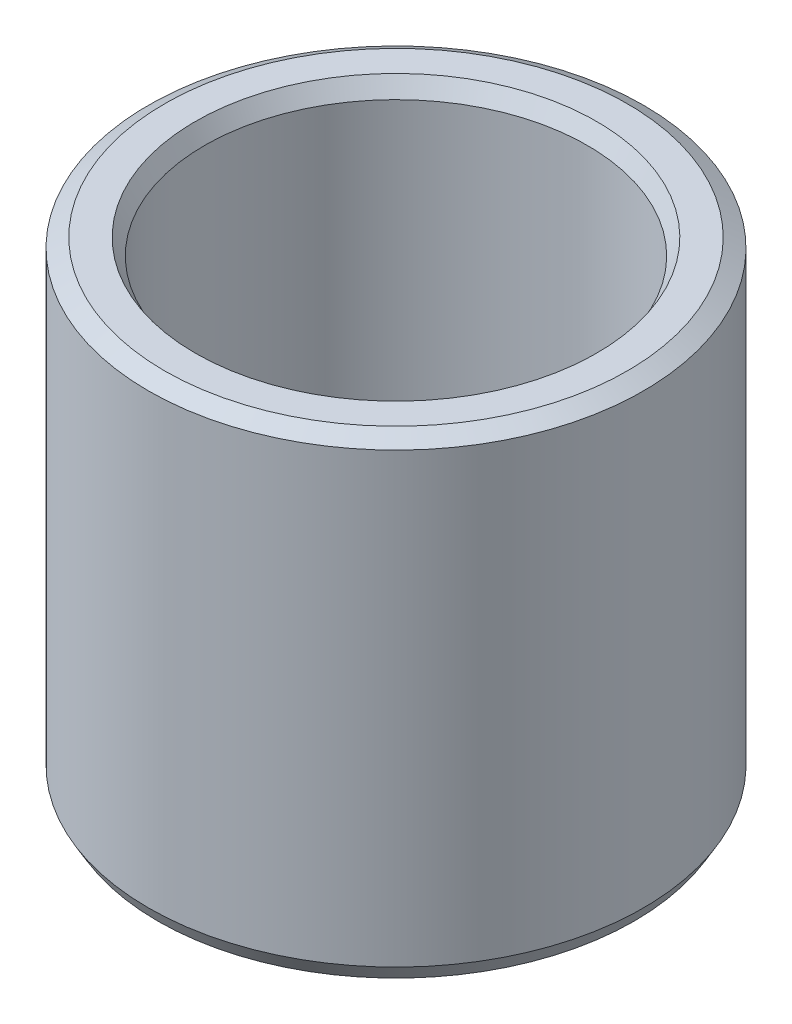
ISO-10303-21;
HEADER;
FILE_DESCRIPTION(('STEP AP214'),'2;1');
FILE_NAME('part.step','',(''),(''),'','','');
FILE_SCHEMA(('AUTOMOTIVE_DESIGN { 1 0 10303 214 1 1 1 1 }'));
ENDSEC;
DATA;
#1=APPLICATION_CONTEXT('core data for automotive mechanical design processes');
#2=APPLICATION_PROTOCOL_DEFINITION('international standard','automotive_design',2000,#1);
#3=PRODUCT_CONTEXT('',#1,'mechanical');
#4=PRODUCT('Part','Part','',(#3));
#5=PRODUCT_RELATED_PRODUCT_CATEGORY('part','',(#4));
#6=PRODUCT_DEFINITION_FORMATION('','',#4);
#7=PRODUCT_DEFINITION_CONTEXT('part definition',#1,'design');
#8=PRODUCT_DEFINITION('design','',#6,#7);
#9=PRODUCT_DEFINITION_SHAPE('','',#8);
#10=(LENGTH_UNIT() NAMED_UNIT(*) SI_UNIT(.MILLI.,.METRE.));
#11=(NAMED_UNIT(*) PLANE_ANGLE_UNIT() SI_UNIT($,.RADIAN.));
#12=(NAMED_UNIT(*) SI_UNIT($,.STERADIAN.) SOLID_ANGLE_UNIT());
#13=UNCERTAINTY_MEASURE_WITH_UNIT(LENGTH_MEASURE(1.E-05),#10,'distance_accuracy_value','');
#14=(GEOMETRIC_REPRESENTATION_CONTEXT(3) GLOBAL_UNCERTAINTY_ASSIGNED_CONTEXT((#13)) GLOBAL_UNIT_ASSIGNED_CONTEXT((#10,
#11,#12)) REPRESENTATION_CONTEXT('',''));
#15=CARTESIAN_POINT('',(0.,0.,0.));
#16=DIRECTION('',(0.,0.,1.));
#17=DIRECTION('',(1.,0.,0.));
#18=AXIS2_PLACEMENT_3D('',#15,#16,#17);
#19=CARTESIAN_POINT('',(0.,66.9073825895051,0.));
#20=DIRECTION('',(0.,-1.,0.));
#21=DIRECTION('',(0.,0.,-1.));
#22=AXIS2_PLACEMENT_3D('',#19,#20,#21);
#23=CYLINDRICAL_SURFACE('',#22,35.);
#24=CARTESIAN_POINT('',(0.,2.27796784596185,0.));
#25=DIRECTION('',(0.,1.,0.));
#26=DIRECTION('',(0.,0.,1.));
#27=AXIS2_PLACEMENT_3D('',#24,#25,#26);
#28=CIRCLE('',#27,35.);
#29=CARTESIAN_POINT('',(0.,2.27796784596185,35.));
#30=VERTEX_POINT('',#29);
#31=EDGE_CURVE('E10',#30,#30,#28,.T.);
#32=ORIENTED_EDGE('',*,*,#31,.T.);
#33=EDGE_LOOP('',(#32));
#34=FACE_BOUND('',#33,.T.);
#35=CARTESIAN_POINT('',(0.,65.5921972404337,0.));
#36=DIRECTION('',(0.,1.,0.));
#37=DIRECTION('',(0.,0.,1.));
#38=AXIS2_PLACEMENT_3D('',#35,#36,#37);
#39=CIRCLE('',#38,35.);
#40=CARTESIAN_POINT('',(0.,65.5921972404337,35.));
#41=VERTEX_POINT('',#40);
#42=EDGE_CURVE('E50',#41,#41,#39,.F.);
#43=ORIENTED_EDGE('',*,*,#42,.T.);
#44=EDGE_LOOP('',(#43));
#45=FACE_BOUND('',#44,.T.);
#46=ADVANCED_FACE('F39',(#34,#45),#23,.T.);
#47=CARTESIAN_POINT('',(0.,66.9073825895051,0.));
#48=DIRECTION('',(0.,1.,0.));
#49=DIRECTION('',(0.,0.,1.));
#50=AXIS2_PLACEMENT_3D('',#47,#48,#49);
#51=PLANE('',#50);
#52=CARTESIAN_POINT('',(0.,66.9073825895051,0.));
#53=DIRECTION('',(0.,1.,0.));
#54=DIRECTION('',(0.,0.,1.));
#55=AXIS2_PLACEMENT_3D('',#52,#53,#54);
#56=CIRCLE('',#55,28.384639879653);
#57=CARTESIAN_POINT('',(0.,66.9073825895051,28.384639879653));
#58=VERTEX_POINT('',#57);
#59=EDGE_CURVE('E58',#58,#58,#56,.F.);
#60=ORIENTED_EDGE('',*,*,#59,.T.);
#61=EDGE_LOOP('',(#60));
#62=FACE_BOUND('',#61,.T.);
#63=CARTESIAN_POINT('',(0.,66.9073825895051,0.));
#64=DIRECTION('',(0.,1.,0.));
#65=DIRECTION('',(0.,0.,1.));
#66=AXIS2_PLACEMENT_3D('',#63,#64,#65);
#67=CIRCLE('',#66,32.7220321540382);
#68=CARTESIAN_POINT('',(0.,66.9073825895051,32.7220321540382));
#69=VERTEX_POINT('',#68);
#70=EDGE_CURVE('E61',#69,#69,#67,.T.);
#71=ORIENTED_EDGE('',*,*,#70,.T.);
#72=EDGE_LOOP('',(#71));
#73=FACE_BOUND('',#72,.T.);
#74=ADVANCED_FACE('F88',(#62,#73),#51,.T.);
#75=CARTESIAN_POINT('',(0.,0.,0.));
#76=DIRECTION('',(0.,1.,0.));
#77=DIRECTION('',(0.,0.,1.));
#78=AXIS2_PLACEMENT_3D('',#75,#76,#77);
#79=PLANE('',#78);
#80=CARTESIAN_POINT('',(0.,0.,0.));
#81=DIRECTION('',(0.,1.,0.));
#82=DIRECTION('',(0.,0.,1.));
#83=AXIS2_PLACEMENT_3D('',#80,#81,#82);
#84=CIRCLE('',#83,29.3474223765435);
#85=CARTESIAN_POINT('',(0.,0.,29.3474223765435));
#86=VERTEX_POINT('',#85);
#87=EDGE_CURVE('E51',#86,#86,#84,.T.);
#88=ORIENTED_EDGE('',*,*,#87,.T.);
#89=EDGE_LOOP('',(#88));
#90=FACE_BOUND('',#89,.T.);
#91=CARTESIAN_POINT('',(0.,0.,0.));
#92=DIRECTION('',(0.,1.,0.));
#93=DIRECTION('',(0.,0.,1.));
#94=AXIS2_PLACEMENT_3D('',#91,#92,#93);
#95=CIRCLE('',#94,33.6848146509286);
#96=CARTESIAN_POINT('',(0.,0.,33.6848146509286));
#97=VERTEX_POINT('',#96);
#98=EDGE_CURVE('E54',#97,#97,#95,.F.);
#99=ORIENTED_EDGE('',*,*,#98,.T.);
#100=EDGE_LOOP('',(#99));
#101=FACE_BOUND('',#100,.T.);
#102=ADVANCED_FACE('F83',(#90,#101),#79,.F.);
#103=CARTESIAN_POINT('',(0.,66.9073825895051,0.));
#104=DIRECTION('',(0.,-1.,0.));
#105=DIRECTION('',(0.,0.,-1.));
#106=AXIS2_PLACEMENT_3D('',#103,#104,#105);
#107=CYLINDRICAL_SURFACE('',#106,27.0694545305817);
#108=CARTESIAN_POINT('',(0.,64.6294147435433,0.));
#109=DIRECTION('',(0.,1.,0.));
#110=DIRECTION('',(0.,0.,1.));
#111=AXIS2_PLACEMENT_3D('',#108,#109,#110);
#112=CIRCLE('',#111,27.0694545305817);
#113=CARTESIAN_POINT('',(0.,64.6294147435433,27.0694545305817));
#114=VERTEX_POINT('',#113);
#115=EDGE_CURVE('E67',#114,#114,#112,.T.);
#116=ORIENTED_EDGE('',*,*,#115,.T.);
#117=EDGE_LOOP('',(#116));
#118=FACE_BOUND('',#117,.T.);
#119=CARTESIAN_POINT('',(0.,1.31518534907137,0.));
#120=DIRECTION('',(0.,1.,0.));
#121=DIRECTION('',(0.,0.,1.));
#122=AXIS2_PLACEMENT_3D('',#119,#120,#121);
#123=CIRCLE('',#122,27.0694545305817);
#124=CARTESIAN_POINT('',(0.,1.31518534907137,27.0694545305817));
#125=VERTEX_POINT('',#124);
#126=EDGE_CURVE('E69',#125,#125,#123,.F.);
#127=ORIENTED_EDGE('',*,*,#126,.T.);
#128=EDGE_LOOP('',(#127));
#129=FACE_BOUND('',#128,.T.);
#130=ADVANCED_FACE('F71',(#118,#129),#107,.F.);
#131=CARTESIAN_POINT('',(0.,64.6294147435433,0.));
#132=DIRECTION('',(0.,1.,0.));
#133=DIRECTION('',(0.,0.,1.));
#134=AXIS2_PLACEMENT_3D('',#131,#132,#133);
#135=CONICAL_SURFACE('',#134,27.0694545305817,0.523598775598297);
#136=ORIENTED_EDGE('',*,*,#59,.F.);
#137=EDGE_LOOP('',(#136));
#138=FACE_BOUND('',#137,.T.);
#139=ORIENTED_EDGE('',*,*,#115,.F.);
#140=EDGE_LOOP('',(#139));
#141=FACE_BOUND('',#140,.T.);
#142=ADVANCED_FACE('F77',(#138,#141),#135,.F.);
#143=CARTESIAN_POINT('',(0.,0.,0.));
#144=DIRECTION('',(0.,-1.,0.));
#145=DIRECTION('',(0.,0.,-1.));
#146=AXIS2_PLACEMENT_3D('',#143,#144,#145);
#147=CONICAL_SURFACE('',#146,29.3474223765435,1.04719755119659);
#148=ORIENTED_EDGE('',*,*,#126,.F.);
#149=EDGE_LOOP('',(#148));
#150=FACE_BOUND('',#149,.T.);
#151=ORIENTED_EDGE('',*,*,#87,.F.);
#152=EDGE_LOOP('',(#151));
#153=FACE_BOUND('',#152,.T.);
#154=ADVANCED_FACE('F73',(#150,#153),#147,.F.);
#155=CARTESIAN_POINT('',(0.,2.27796784596185,0.));
#156=DIRECTION('',(0.,1.,0.));
#157=DIRECTION('',(0.,0.,1.));
#158=AXIS2_PLACEMENT_3D('',#155,#156,#157);
#159=CONICAL_SURFACE('',#158,35.,0.523598775598302);
#160=ORIENTED_EDGE('',*,*,#98,.F.);
#161=EDGE_LOOP('',(#160));
#162=FACE_BOUND('',#161,.T.);
#163=ORIENTED_EDGE('',*,*,#31,.F.);
#164=EDGE_LOOP('',(#163));
#165=FACE_BOUND('',#164,.T.);
#166=ADVANCED_FACE('F76',(#162,#165),#159,.T.);
#167=CARTESIAN_POINT('',(0.,66.9073825895051,0.));
#168=DIRECTION('',(0.,-1.,0.));
#169=DIRECTION('',(0.,0.,-1.));
#170=AXIS2_PLACEMENT_3D('',#167,#168,#169);
#171=CONICAL_SURFACE('',#170,32.7220321540382,1.04719755119659);
#172=ORIENTED_EDGE('',*,*,#42,.F.);
#173=EDGE_LOOP('',(#172));
#174=FACE_BOUND('',#173,.T.);
#175=ORIENTED_EDGE('',*,*,#70,.F.);
#176=EDGE_LOOP('',(#175));
#177=FACE_BOUND('',#176,.T.);
#178=ADVANCED_FACE('F45',(#174,#177),#171,.T.);
#179=CLOSED_SHELL('',(#46,#74,#102,#130,#142,#154,#166,#178));
#180=MANIFOLD_SOLID_BREP('B2',#179);
#181=ADVANCED_BREP_SHAPE_REPRESENTATION('',(#18,#180),#14);
#182=SHAPE_DEFINITION_REPRESENTATION(#9,#181);
ENDSEC;
END-ISO-10303-21;
